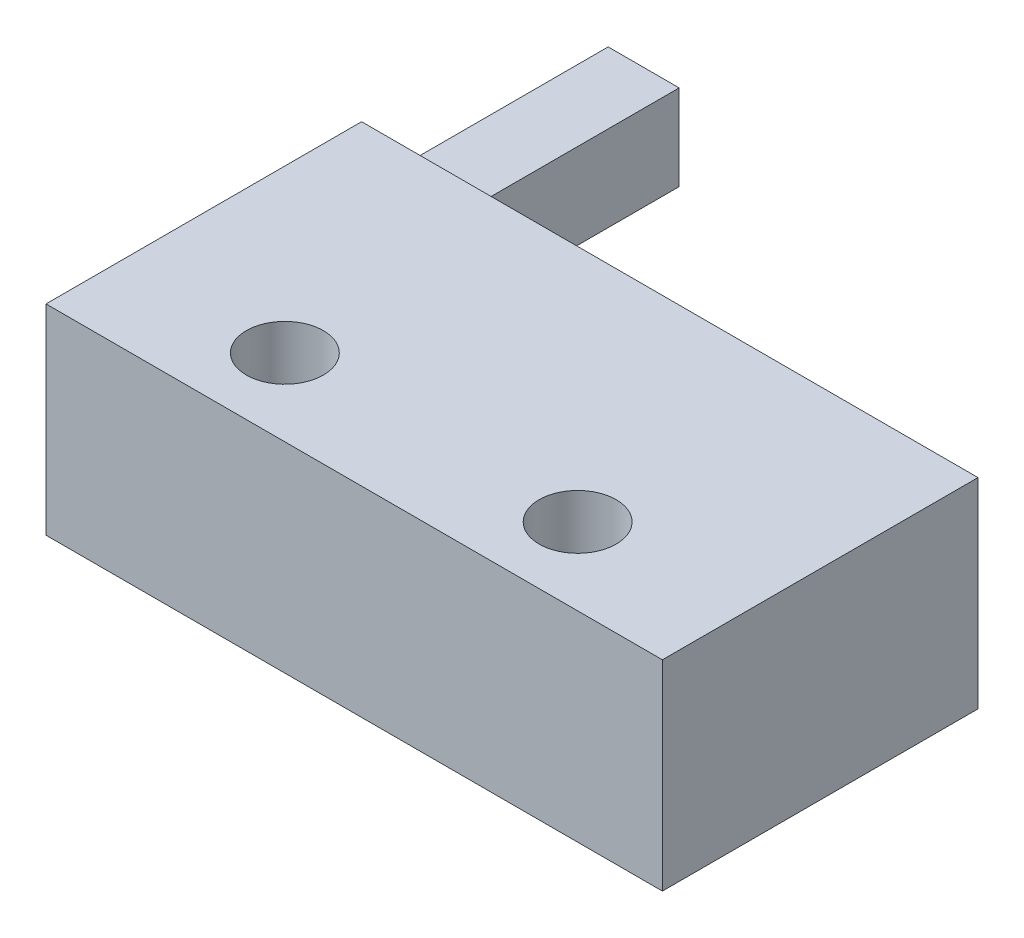
ISO-10303-21;
HEADER;
FILE_DESCRIPTION(('STEP AP214'),'2;1');
FILE_NAME('part.step','',(''),(''),'','','');
FILE_SCHEMA(('AUTOMOTIVE_DESIGN { 1 0 10303 214 1 1 1 1 }'));
ENDSEC;
DATA;
#1=APPLICATION_CONTEXT('core data for automotive mechanical design processes');
#2=APPLICATION_PROTOCOL_DEFINITION('international standard','automotive_design',2000,#1);
#3=PRODUCT_CONTEXT('',#1,'mechanical');
#4=PRODUCT('Part','Part','',(#3));
#5=PRODUCT_RELATED_PRODUCT_CATEGORY('part','',(#4));
#6=PRODUCT_DEFINITION_FORMATION('','',#4);
#7=PRODUCT_DEFINITION_CONTEXT('part definition',#1,'design');
#8=PRODUCT_DEFINITION('design','',#6,#7);
#9=PRODUCT_DEFINITION_SHAPE('','',#8);
#10=(LENGTH_UNIT() NAMED_UNIT(*) SI_UNIT(.MILLI.,.METRE.));
#11=(NAMED_UNIT(*) PLANE_ANGLE_UNIT() SI_UNIT($,.RADIAN.));
#12=(NAMED_UNIT(*) SI_UNIT($,.STERADIAN.) SOLID_ANGLE_UNIT());
#13=UNCERTAINTY_MEASURE_WITH_UNIT(LENGTH_MEASURE(1.E-05),#10,'distance_accuracy_value','');
#14=(GEOMETRIC_REPRESENTATION_CONTEXT(3) GLOBAL_UNCERTAINTY_ASSIGNED_CONTEXT((#13)) GLOBAL_UNIT_ASSIGNED_CONTEXT((#10,
#11,#12)) REPRESENTATION_CONTEXT('',''));
#15=CARTESIAN_POINT('',(0.,0.,0.));
#16=DIRECTION('',(0.,0.,1.));
#17=DIRECTION('',(1.,0.,0.));
#18=AXIS2_PLACEMENT_3D('',#15,#16,#17);
#19=CARTESIAN_POINT('',(-10.,6.5,-5.12));
#20=DIRECTION('',(0.,0.,1.));
#21=DIRECTION('',(1.,0.,0.));
#22=AXIS2_PLACEMENT_3D('',#19,#20,#21);
#23=PLANE('',#22);
#24=DIRECTION('',(-1.,0.,0.));
#25=VECTOR('',#24,1.);
#26=CARTESIAN_POINT('',(-7.69639555596445,1.82590280860911,-5.12));
#27=LINE('',#26,#25);
#28=CARTESIAN_POINT('',(-7.69639555596445,1.82590280860911,-5.12));
#29=VERTEX_POINT('',#28);
#30=CARTESIAN_POINT('',(-10.,1.82590280860911,-5.12));
#31=VERTEX_POINT('',#30);
#32=EDGE_CURVE('E57',#29,#31,#27,.T.);
#33=ORIENTED_EDGE('',*,*,#32,.F.);
#34=DIRECTION('',(0.,-1.,0.));
#35=VECTOR('',#34,1.);
#36=CARTESIAN_POINT('',(-7.69639555596445,4.60180799385843,-5.12));
#37=LINE('',#36,#35);
#38=CARTESIAN_POINT('',(-7.69639555596445,4.60180799385843,-5.12));
#39=VERTEX_POINT('',#38);
#40=EDGE_CURVE('E207',#39,#29,#37,.T.);
#41=ORIENTED_EDGE('',*,*,#40,.F.);
#42=DIRECTION('',(1.,0.,0.));
#43=VECTOR('',#42,1.);
#44=CARTESIAN_POINT('',(-7.69639555596445,4.60180799385843,-5.12));
#45=LINE('',#44,#43);
#46=CARTESIAN_POINT('',(-10.,4.60180799385843,-5.12));
#47=VERTEX_POINT('',#46);
#48=EDGE_CURVE('E206',#47,#39,#45,.T.);
#49=ORIENTED_EDGE('',*,*,#48,.F.);
#50=DIRECTION('',(0.,-1.,0.));
#51=VECTOR('',#50,1.);
#52=CARTESIAN_POINT('',(-10.,6.5,-5.12));
#53=LINE('',#52,#51);
#54=CARTESIAN_POINT('',(-10.,6.5,-5.12));
#55=VERTEX_POINT('',#54);
#56=EDGE_CURVE('E50',#55,#47,#53,.T.);
#57=ORIENTED_EDGE('',*,*,#56,.F.);
#58=DIRECTION('',(-1.,0.,0.));
#59=VECTOR('',#58,1.);
#60=CARTESIAN_POINT('',(-10.,6.5,-5.12));
#61=LINE('',#60,#59);
#62=CARTESIAN_POINT('',(10.,6.5,-5.12));
#63=VERTEX_POINT('',#62);
#64=EDGE_CURVE('E160',#63,#55,#61,.T.);
#65=ORIENTED_EDGE('',*,*,#64,.F.);
#66=DIRECTION('',(0.,-1.,0.));
#67=VECTOR('',#66,1.);
#68=CARTESIAN_POINT('',(10.,6.5,-5.12));
#69=LINE('',#68,#67);
#70=CARTESIAN_POINT('',(10.,0.,-5.12));
#71=VERTEX_POINT('',#70);
#72=EDGE_CURVE('E11',#63,#71,#69,.T.);
#73=ORIENTED_EDGE('',*,*,#72,.T.);
#74=DIRECTION('',(-1.,0.,0.));
#75=VECTOR('',#74,1.);
#76=CARTESIAN_POINT('',(-10.,0.,-5.12));
#77=LINE('',#76,#75);
#78=CARTESIAN_POINT('',(-10.,0.,-5.12));
#79=VERTEX_POINT('',#78);
#80=EDGE_CURVE('E174',#71,#79,#77,.T.);
#81=ORIENTED_EDGE('',*,*,#80,.T.);
#82=EDGE_CURVE('E62',#31,#79,#53,.T.);
#83=ORIENTED_EDGE('',*,*,#82,.F.);
#84=EDGE_LOOP('',(#33,#41,#49,#57,#65,#73,#81,#83));
#85=FACE_BOUND('',#84,.T.);
#86=ADVANCED_FACE('F41',(#85),#23,.F.);
#87=CARTESIAN_POINT('',(10.,6.5,-5.12));
#88=DIRECTION('',(-1.,0.,0.));
#89=DIRECTION('',(0.,0.,1.));
#90=AXIS2_PLACEMENT_3D('',#87,#88,#89);
#91=PLANE('',#90);
#92=DIRECTION('',(0.,0.,-1.));
#93=VECTOR('',#92,1.);
#94=CARTESIAN_POINT('',(10.,0.,-5.12));
#95=LINE('',#94,#93);
#96=CARTESIAN_POINT('',(10.,0.,5.12));
#97=VERTEX_POINT('',#96);
#98=EDGE_CURVE('E148',#97,#71,#95,.T.);
#99=ORIENTED_EDGE('',*,*,#98,.T.);
#100=ORIENTED_EDGE('',*,*,#72,.F.);
#101=DIRECTION('',(0.,0.,-1.));
#102=VECTOR('',#101,1.);
#103=CARTESIAN_POINT('',(10.,6.5,-5.12));
#104=LINE('',#103,#102);
#105=CARTESIAN_POINT('',(10.,6.5,5.12));
#106=VERTEX_POINT('',#105);
#107=EDGE_CURVE('E156',#106,#63,#104,.T.);
#108=ORIENTED_EDGE('',*,*,#107,.F.);
#109=DIRECTION('',(0.,-1.,0.));
#110=VECTOR('',#109,1.);
#111=CARTESIAN_POINT('',(10.,6.5,5.12));
#112=LINE('',#111,#110);
#113=EDGE_CURVE('E170',#106,#97,#112,.T.);
#114=ORIENTED_EDGE('',*,*,#113,.T.);
#115=EDGE_LOOP('',(#99,#100,#108,#114));
#116=FACE_BOUND('',#115,.T.);
#117=ADVANCED_FACE('F43',(#116),#91,.F.);
#118=CARTESIAN_POINT('',(-10.,6.5,-5.12));
#119=DIRECTION('',(1.,0.,0.));
#120=DIRECTION('',(0.,0.,-1.));
#121=AXIS2_PLACEMENT_3D('',#118,#119,#120);
#122=PLANE('',#121);
#123=DIRECTION('',(0.,0.,1.));
#124=VECTOR('',#123,1.);
#125=CARTESIAN_POINT('',(-10.,0.,-5.12));
#126=LINE('',#125,#124);
#127=CARTESIAN_POINT('',(-10.,0.,5.12));
#128=VERTEX_POINT('',#127);
#129=EDGE_CURVE('E177',#79,#128,#126,.T.);
#130=ORIENTED_EDGE('',*,*,#129,.T.);
#131=DIRECTION('',(0.,-1.,0.));
#132=VECTOR('',#131,1.);
#133=CARTESIAN_POINT('',(-10.,6.5,5.12));
#134=LINE('',#133,#132);
#135=CARTESIAN_POINT('',(-10.,6.5,5.12));
#136=VERTEX_POINT('',#135);
#137=EDGE_CURVE('E185',#136,#128,#134,.T.);
#138=ORIENTED_EDGE('',*,*,#137,.F.);
#139=DIRECTION('',(0.,0.,1.));
#140=VECTOR('',#139,1.);
#141=CARTESIAN_POINT('',(-10.,6.5,-5.12));
#142=LINE('',#141,#140);
#143=EDGE_CURVE('E164',#55,#136,#142,.T.);
#144=ORIENTED_EDGE('',*,*,#143,.F.);
#145=ORIENTED_EDGE('',*,*,#56,.T.);
#146=DIRECTION('',(0.,0.,1.));
#147=VECTOR('',#146,1.);
#148=CARTESIAN_POINT('',(-10.,4.60180799385843,-13.12));
#149=LINE('',#148,#147);
#150=CARTESIAN_POINT('',(-10.,4.60180799385843,-13.12));
#151=VERTEX_POINT('',#150);
#152=EDGE_CURVE('E110',#151,#47,#149,.T.);
#153=ORIENTED_EDGE('',*,*,#152,.F.);
#154=DIRECTION('',(0.,1.,0.));
#155=VECTOR('',#154,1.);
#156=CARTESIAN_POINT('',(-10.,4.60180799385843,-13.12));
#157=LINE('',#156,#155);
#158=CARTESIAN_POINT('',(-10.,1.82590280860911,-13.12));
#159=VERTEX_POINT('',#158);
#160=EDGE_CURVE('E117',#159,#151,#157,.T.);
#161=ORIENTED_EDGE('',*,*,#160,.F.);
#162=DIRECTION('',(0.,0.,1.));
#163=VECTOR('',#162,1.);
#164=CARTESIAN_POINT('',(-10.,1.82590280860911,-13.12));
#165=LINE('',#164,#163);
#166=EDGE_CURVE('E192',#159,#31,#165,.T.);
#167=ORIENTED_EDGE('',*,*,#166,.T.);
#168=ORIENTED_EDGE('',*,*,#82,.T.);
#169=EDGE_LOOP('',(#130,#138,#144,#145,#153,#161,#167,#168));
#170=FACE_BOUND('',#169,.T.);
#171=ADVANCED_FACE('F129',(#170),#122,.F.);
#172=CARTESIAN_POINT('',(-10.,6.5,5.12));
#173=DIRECTION('',(0.,0.,-1.));
#174=DIRECTION('',(-1.,0.,0.));
#175=AXIS2_PLACEMENT_3D('',#172,#173,#174);
#176=PLANE('',#175);
#177=DIRECTION('',(1.,0.,0.));
#178=VECTOR('',#177,1.);
#179=CARTESIAN_POINT('',(-10.,0.,5.12));
#180=LINE('',#179,#178);
#181=EDGE_CURVE('E161',#128,#97,#180,.T.);
#182=ORIENTED_EDGE('',*,*,#181,.T.);
#183=ORIENTED_EDGE('',*,*,#113,.F.);
#184=DIRECTION('',(1.,0.,0.));
#185=VECTOR('',#184,1.);
#186=CARTESIAN_POINT('',(-10.,6.5,5.12));
#187=LINE('',#186,#185);
#188=EDGE_CURVE('E167',#136,#106,#187,.T.);
#189=ORIENTED_EDGE('',*,*,#188,.F.);
#190=ORIENTED_EDGE('',*,*,#137,.T.);
#191=EDGE_LOOP('',(#182,#183,#189,#190));
#192=FACE_BOUND('',#191,.T.);
#193=ADVANCED_FACE('F200',(#192),#176,.F.);
#194=CARTESIAN_POINT('',(0.,6.5,0.));
#195=DIRECTION('',(0.,1.,0.));
#196=DIRECTION('',(0.,0.,1.));
#197=AXIS2_PLACEMENT_3D('',#194,#195,#196);
#198=PLANE('',#197);
#199=CARTESIAN_POINT('',(-4.75,6.5,2.62));
#200=DIRECTION('',(0.,1.,0.));
#201=DIRECTION('',(0.,0.,1.));
#202=AXIS2_PLACEMENT_3D('',#199,#200,#201);
#203=CIRCLE('',#202,1.25);
#204=CARTESIAN_POINT('',(-4.75,6.5,3.87));
#205=VERTEX_POINT('',#204);
#206=EDGE_CURVE('E149',#205,#205,#203,.T.);
#207=ORIENTED_EDGE('',*,*,#206,.F.);
#208=EDGE_LOOP('',(#207));
#209=FACE_BOUND('',#208,.T.);
#210=CARTESIAN_POINT('',(4.75,6.5,2.62));
#211=DIRECTION('',(0.,1.,0.));
#212=DIRECTION('',(0.,0.,-1.));
#213=AXIS2_PLACEMENT_3D('',#210,#211,#212);
#214=CIRCLE('',#213,1.25);
#215=CARTESIAN_POINT('',(4.75,6.5,1.37));
#216=VERTEX_POINT('',#215);
#217=EDGE_CURVE('E133',#216,#216,#214,.T.);
#218=ORIENTED_EDGE('',*,*,#217,.F.);
#219=EDGE_LOOP('',(#218));
#220=FACE_BOUND('',#219,.T.);
#221=ORIENTED_EDGE('',*,*,#107,.T.);
#222=ORIENTED_EDGE('',*,*,#64,.T.);
#223=ORIENTED_EDGE('',*,*,#143,.T.);
#224=ORIENTED_EDGE('',*,*,#188,.T.);
#225=EDGE_LOOP('',(#221,#222,#223,#224));
#226=FACE_BOUND('',#225,.T.);
#227=ADVANCED_FACE('F205',(#209,#220,#226),#198,.T.);
#228=CARTESIAN_POINT('',(0.,0.,0.));
#229=DIRECTION('',(0.,1.,0.));
#230=DIRECTION('',(0.,0.,1.));
#231=AXIS2_PLACEMENT_3D('',#228,#229,#230);
#232=PLANE('',#231);
#233=CARTESIAN_POINT('',(-4.75,0.,2.62));
#234=DIRECTION('',(0.,1.,0.));
#235=DIRECTION('',(0.,0.,1.));
#236=AXIS2_PLACEMENT_3D('',#233,#234,#235);
#237=CIRCLE('',#236,1.25);
#238=CARTESIAN_POINT('',(-4.75,0.,3.87));
#239=VERTEX_POINT('',#238);
#240=EDGE_CURVE('E144',#239,#239,#237,.T.);
#241=ORIENTED_EDGE('',*,*,#240,.T.);
#242=EDGE_LOOP('',(#241));
#243=FACE_BOUND('',#242,.T.);
#244=CARTESIAN_POINT('',(4.75,0.,2.62));
#245=DIRECTION('',(0.,1.,0.));
#246=DIRECTION('',(0.,0.,-1.));
#247=AXIS2_PLACEMENT_3D('',#244,#245,#246);
#248=CIRCLE('',#247,1.25);
#249=CARTESIAN_POINT('',(4.75,0.,1.37));
#250=VERTEX_POINT('',#249);
#251=EDGE_CURVE('E138',#250,#250,#248,.T.);
#252=ORIENTED_EDGE('',*,*,#251,.T.);
#253=EDGE_LOOP('',(#252));
#254=FACE_BOUND('',#253,.T.);
#255=ORIENTED_EDGE('',*,*,#98,.F.);
#256=ORIENTED_EDGE('',*,*,#181,.F.);
#257=ORIENTED_EDGE('',*,*,#129,.F.);
#258=ORIENTED_EDGE('',*,*,#80,.F.);
#259=EDGE_LOOP('',(#255,#256,#257,#258));
#260=FACE_BOUND('',#259,.T.);
#261=ADVANCED_FACE('F197',(#243,#254,#260),#232,.F.);
#262=CARTESIAN_POINT('',(4.75,0.,2.62));
#263=DIRECTION('',(0.,1.,0.));
#264=DIRECTION('',(0.,0.,1.));
#265=AXIS2_PLACEMENT_3D('',#262,#263,#264);
#266=CYLINDRICAL_SURFACE('',#265,1.25);
#267=ORIENTED_EDGE('',*,*,#251,.F.);
#268=EDGE_LOOP('',(#267));
#269=FACE_BOUND('',#268,.T.);
#270=ORIENTED_EDGE('',*,*,#217,.T.);
#271=EDGE_LOOP('',(#270));
#272=FACE_BOUND('',#271,.T.);
#273=ADVANCED_FACE('F247',(#269,#272),#266,.F.);
#274=CARTESIAN_POINT('',(-4.75,0.,2.62));
#275=DIRECTION('',(0.,1.,0.));
#276=DIRECTION('',(0.,0.,1.));
#277=AXIS2_PLACEMENT_3D('',#274,#275,#276);
#278=CYLINDRICAL_SURFACE('',#277,1.25);
#279=ORIENTED_EDGE('',*,*,#240,.F.);
#280=EDGE_LOOP('',(#279));
#281=FACE_BOUND('',#280,.T.);
#282=ORIENTED_EDGE('',*,*,#206,.T.);
#283=EDGE_LOOP('',(#282));
#284=FACE_BOUND('',#283,.T.);
#285=ADVANCED_FACE('F234',(#281,#284),#278,.F.);
#286=CARTESIAN_POINT('',(-7.69639555596445,4.60180799385843,-13.12));
#287=DIRECTION('',(0.,-1.,0.));
#288=DIRECTION('',(0.,0.,-1.));
#289=AXIS2_PLACEMENT_3D('',#286,#287,#288);
#290=PLANE('',#289);
#291=ORIENTED_EDGE('',*,*,#48,.T.);
#292=DIRECTION('',(0.,0.,1.));
#293=VECTOR('',#292,1.);
#294=CARTESIAN_POINT('',(-7.69639555596445,4.60180799385843,-13.12));
#295=LINE('',#294,#293);
#296=CARTESIAN_POINT('',(-7.69639555596445,4.60180799385843,-13.12));
#297=VERTEX_POINT('',#296);
#298=EDGE_CURVE('E112',#297,#39,#295,.T.);
#299=ORIENTED_EDGE('',*,*,#298,.F.);
#300=DIRECTION('',(1.,0.,0.));
#301=VECTOR('',#300,1.);
#302=CARTESIAN_POINT('',(-7.69639555596445,4.60180799385843,-13.12));
#303=LINE('',#302,#301);
#304=EDGE_CURVE('E105',#151,#297,#303,.T.);
#305=ORIENTED_EDGE('',*,*,#304,.F.);
#306=ORIENTED_EDGE('',*,*,#152,.T.);
#307=EDGE_LOOP('',(#291,#299,#305,#306));
#308=FACE_BOUND('',#307,.T.);
#309=ADVANCED_FACE('F108',(#308),#290,.F.);
#310=CARTESIAN_POINT('',(-7.69639555596445,4.60180799385843,-13.12));
#311=DIRECTION('',(-1.,0.,0.));
#312=DIRECTION('',(0.,0.,1.));
#313=AXIS2_PLACEMENT_3D('',#310,#311,#312);
#314=PLANE('',#313);
#315=ORIENTED_EDGE('',*,*,#40,.T.);
#316=DIRECTION('',(0.,0.,1.));
#317=VECTOR('',#316,1.);
#318=CARTESIAN_POINT('',(-7.69639555596445,1.82590280860911,-13.12));
#319=LINE('',#318,#317);
#320=CARTESIAN_POINT('',(-7.69639555596445,1.82590280860911,-13.12));
#321=VERTEX_POINT('',#320);
#322=EDGE_CURVE('E140',#321,#29,#319,.T.);
#323=ORIENTED_EDGE('',*,*,#322,.F.);
#324=DIRECTION('',(0.,-1.,0.));
#325=VECTOR('',#324,1.);
#326=CARTESIAN_POINT('',(-7.69639555596445,4.60180799385843,-13.12));
#327=LINE('',#326,#325);
#328=EDGE_CURVE('E116',#297,#321,#327,.T.);
#329=ORIENTED_EDGE('',*,*,#328,.F.);
#330=ORIENTED_EDGE('',*,*,#298,.T.);
#331=EDGE_LOOP('',(#315,#323,#329,#330));
#332=FACE_BOUND('',#331,.T.);
#333=ADVANCED_FACE('F224',(#332),#314,.F.);
#334=CARTESIAN_POINT('',(-7.69639555596445,1.82590280860911,-13.12));
#335=DIRECTION('',(0.,1.,0.));
#336=DIRECTION('',(0.,0.,1.));
#337=AXIS2_PLACEMENT_3D('',#334,#335,#336);
#338=PLANE('',#337);
#339=ORIENTED_EDGE('',*,*,#32,.T.);
#340=ORIENTED_EDGE('',*,*,#166,.F.);
#341=DIRECTION('',(-1.,0.,0.));
#342=VECTOR('',#341,1.);
#343=CARTESIAN_POINT('',(-7.69639555596445,1.82590280860911,-13.12));
#344=LINE('',#343,#342);
#345=EDGE_CURVE('E122',#321,#159,#344,.T.);
#346=ORIENTED_EDGE('',*,*,#345,.F.);
#347=ORIENTED_EDGE('',*,*,#322,.T.);
#348=EDGE_LOOP('',(#339,#340,#346,#347));
#349=FACE_BOUND('',#348,.T.);
#350=ADVANCED_FACE('F222',(#349),#338,.F.);
#351=CARTESIAN_POINT('',(0.,0.,-13.12));
#352=DIRECTION('',(0.,0.,-1.));
#353=DIRECTION('',(-1.,0.,0.));
#354=AXIS2_PLACEMENT_3D('',#351,#352,#353);
#355=PLANE('',#354);
#356=ORIENTED_EDGE('',*,*,#160,.T.);
#357=ORIENTED_EDGE('',*,*,#304,.T.);
#358=ORIENTED_EDGE('',*,*,#328,.T.);
#359=ORIENTED_EDGE('',*,*,#345,.T.);
#360=EDGE_LOOP('',(#356,#357,#358,#359));
#361=FACE_BOUND('',#360,.T.);
#362=ADVANCED_FACE('F120',(#361),#355,.T.);
#363=CLOSED_SHELL('',(#86,#117,#171,#193,#227,#261,#273,#285,#309,#333,#350,#362));
#364=MANIFOLD_SOLID_BREP('B2',#363);
#365=ADVANCED_BREP_SHAPE_REPRESENTATION('',(#18,#364),#14);
#366=SHAPE_DEFINITION_REPRESENTATION(#9,#365);
ENDSEC;
END-ISO-10303-21;
